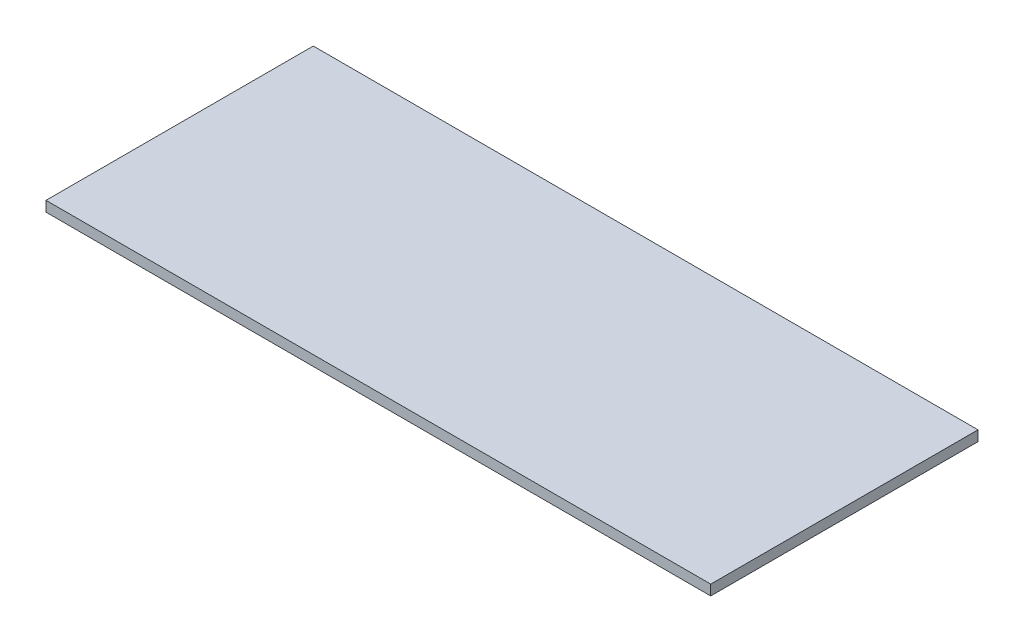
ISO-10303-21;
HEADER;
FILE_DESCRIPTION(('STEP AP214'),'2;1');
FILE_NAME('part.step','',(''),(''),'','','');
FILE_SCHEMA(('AUTOMOTIVE_DESIGN { 1 0 10303 214 1 1 1 1 }'));
ENDSEC;
DATA;
#1=APPLICATION_CONTEXT('core data for automotive mechanical design processes');
#2=APPLICATION_PROTOCOL_DEFINITION('international standard','automotive_design',2000,#1);
#3=PRODUCT_CONTEXT('',#1,'mechanical');
#4=PRODUCT('Part','Part','',(#3));
#5=PRODUCT_RELATED_PRODUCT_CATEGORY('part','',(#4));
#6=PRODUCT_DEFINITION_FORMATION('','',#4);
#7=PRODUCT_DEFINITION_CONTEXT('part definition',#1,'design');
#8=PRODUCT_DEFINITION('design','',#6,#7);
#9=PRODUCT_DEFINITION_SHAPE('','',#8);
#10=(LENGTH_UNIT() NAMED_UNIT(*) SI_UNIT(.MILLI.,.METRE.));
#11=(NAMED_UNIT(*) PLANE_ANGLE_UNIT() SI_UNIT($,.RADIAN.));
#12=(NAMED_UNIT(*) SI_UNIT($,.STERADIAN.) SOLID_ANGLE_UNIT());
#13=UNCERTAINTY_MEASURE_WITH_UNIT(LENGTH_MEASURE(1.E-05),#10,'distance_accuracy_value','');
#14=(GEOMETRIC_REPRESENTATION_CONTEXT(3) GLOBAL_UNCERTAINTY_ASSIGNED_CONTEXT((#13)) GLOBAL_UNIT_ASSIGNED_CONTEXT((#10,
#11,#12)) REPRESENTATION_CONTEXT('',''));
#15=CARTESIAN_POINT('',(0.,0.,0.));
#16=DIRECTION('',(0.,0.,1.));
#17=DIRECTION('',(1.,0.,0.));
#18=AXIS2_PLACEMENT_3D('',#15,#16,#17);
#19=CARTESIAN_POINT('',(-97.,3.,39.));
#20=DIRECTION('',(1.,0.,0.));
#21=DIRECTION('',(0.,0.,-1.));
#22=AXIS2_PLACEMENT_3D('',#19,#20,#21);
#23=PLANE('',#22);
#24=DIRECTION('',(0.,0.,1.));
#25=VECTOR('',#24,1.);
#26=CARTESIAN_POINT('',(-97.,0.,39.));
#27=LINE('',#26,#25);
#28=CARTESIAN_POINT('',(-97.,0.,-39.));
#29=VERTEX_POINT('',#28);
#30=CARTESIAN_POINT('',(-97.,0.,39.));
#31=VERTEX_POINT('',#30);
#32=EDGE_CURVE('E100',#29,#31,#27,.T.);
#33=ORIENTED_EDGE('',*,*,#32,.T.);
#34=DIRECTION('',(0.,-1.,0.));
#35=VECTOR('',#34,1.);
#36=CARTESIAN_POINT('',(-97.,3.,39.));
#37=LINE('',#36,#35);
#38=CARTESIAN_POINT('',(-97.,3.,39.));
#39=VERTEX_POINT('',#38);
#40=EDGE_CURVE('E11',#39,#31,#37,.T.);
#41=ORIENTED_EDGE('',*,*,#40,.F.);
#42=DIRECTION('',(0.,0.,1.));
#43=VECTOR('',#42,1.);
#44=CARTESIAN_POINT('',(-97.,3.,39.));
#45=LINE('',#44,#43);
#46=CARTESIAN_POINT('',(-97.,3.,-39.));
#47=VERTEX_POINT('',#46);
#48=EDGE_CURVE('E88',#47,#39,#45,.T.);
#49=ORIENTED_EDGE('',*,*,#48,.F.);
#50=DIRECTION('',(0.,-1.,0.));
#51=VECTOR('',#50,1.);
#52=CARTESIAN_POINT('',(-97.,3.,-39.));
#53=LINE('',#52,#51);
#54=EDGE_CURVE('E96',#47,#29,#53,.T.);
#55=ORIENTED_EDGE('',*,*,#54,.T.);
#56=EDGE_LOOP('',(#33,#41,#49,#55));
#57=FACE_BOUND('',#56,.T.);
#58=ADVANCED_FACE('F37',(#57),#23,.F.);
#59=CARTESIAN_POINT('',(97.,3.,39.));
#60=DIRECTION('',(0.,0.,-1.));
#61=DIRECTION('',(-1.,0.,0.));
#62=AXIS2_PLACEMENT_3D('',#59,#60,#61);
#63=PLANE('',#62);
#64=DIRECTION('',(1.,0.,0.));
#65=VECTOR('',#64,1.);
#66=CARTESIAN_POINT('',(97.,0.,39.));
#67=LINE('',#66,#65);
#68=CARTESIAN_POINT('',(97.,0.,39.));
#69=VERTEX_POINT('',#68);
#70=EDGE_CURVE('E92',#31,#69,#67,.T.);
#71=ORIENTED_EDGE('',*,*,#70,.T.);
#72=DIRECTION('',(0.,-1.,0.));
#73=VECTOR('',#72,1.);
#74=CARTESIAN_POINT('',(97.,3.,39.));
#75=LINE('',#74,#73);
#76=CARTESIAN_POINT('',(97.,3.,39.));
#77=VERTEX_POINT('',#76);
#78=EDGE_CURVE('E45',#77,#69,#75,.T.);
#79=ORIENTED_EDGE('',*,*,#78,.F.);
#80=DIRECTION('',(1.,0.,0.));
#81=VECTOR('',#80,1.);
#82=CARTESIAN_POINT('',(97.,3.,39.));
#83=LINE('',#82,#81);
#84=EDGE_CURVE('E83',#39,#77,#83,.T.);
#85=ORIENTED_EDGE('',*,*,#84,.F.);
#86=ORIENTED_EDGE('',*,*,#40,.T.);
#87=EDGE_LOOP('',(#71,#79,#85,#86));
#88=FACE_BOUND('',#87,.T.);
#89=ADVANCED_FACE('F91',(#88),#63,.F.);
#90=CARTESIAN_POINT('',(97.,3.,39.));
#91=DIRECTION('',(-1.,0.,0.));
#92=DIRECTION('',(0.,0.,1.));
#93=AXIS2_PLACEMENT_3D('',#90,#91,#92);
#94=PLANE('',#93);
#95=DIRECTION('',(0.,0.,-1.));
#96=VECTOR('',#95,1.);
#97=CARTESIAN_POINT('',(97.,0.,39.));
#98=LINE('',#97,#96);
#99=CARTESIAN_POINT('',(97.,0.,-39.));
#100=VERTEX_POINT('',#99);
#101=EDGE_CURVE('E70',#69,#100,#98,.T.);
#102=ORIENTED_EDGE('',*,*,#101,.T.);
#103=DIRECTION('',(0.,-1.,0.));
#104=VECTOR('',#103,1.);
#105=CARTESIAN_POINT('',(97.,3.,-39.));
#106=LINE('',#105,#104);
#107=CARTESIAN_POINT('',(97.,3.,-39.));
#108=VERTEX_POINT('',#107);
#109=EDGE_CURVE('E93',#108,#100,#106,.T.);
#110=ORIENTED_EDGE('',*,*,#109,.F.);
#111=DIRECTION('',(0.,0.,-1.));
#112=VECTOR('',#111,1.);
#113=CARTESIAN_POINT('',(97.,3.,39.));
#114=LINE('',#113,#112);
#115=EDGE_CURVE('E86',#77,#108,#114,.T.);
#116=ORIENTED_EDGE('',*,*,#115,.F.);
#117=ORIENTED_EDGE('',*,*,#78,.T.);
#118=EDGE_LOOP('',(#102,#110,#116,#117));
#119=FACE_BOUND('',#118,.T.);
#120=ADVANCED_FACE('F94',(#119),#94,.F.);
#121=CARTESIAN_POINT('',(97.,3.,-39.));
#122=DIRECTION('',(0.,0.,1.));
#123=DIRECTION('',(1.,0.,0.));
#124=AXIS2_PLACEMENT_3D('',#121,#122,#123);
#125=PLANE('',#124);
#126=DIRECTION('',(-1.,0.,0.));
#127=VECTOR('',#126,1.);
#128=CARTESIAN_POINT('',(97.,0.,-39.));
#129=LINE('',#128,#127);
#130=EDGE_CURVE('E76',#100,#29,#129,.T.);
#131=ORIENTED_EDGE('',*,*,#130,.T.);
#132=ORIENTED_EDGE('',*,*,#54,.F.);
#133=DIRECTION('',(-1.,0.,0.));
#134=VECTOR('',#133,1.);
#135=CARTESIAN_POINT('',(97.,3.,-39.));
#136=LINE('',#135,#134);
#137=EDGE_CURVE('E53',#108,#47,#136,.T.);
#138=ORIENTED_EDGE('',*,*,#137,.F.);
#139=ORIENTED_EDGE('',*,*,#109,.T.);
#140=EDGE_LOOP('',(#131,#132,#138,#139));
#141=FACE_BOUND('',#140,.T.);
#142=ADVANCED_FACE('F107',(#141),#125,.F.);
#143=CARTESIAN_POINT('',(0.,3.,0.));
#144=DIRECTION('',(0.,1.,0.));
#145=DIRECTION('',(0.,0.,1.));
#146=AXIS2_PLACEMENT_3D('',#143,#144,#145);
#147=PLANE('',#146);
#148=ORIENTED_EDGE('',*,*,#48,.T.);
#149=ORIENTED_EDGE('',*,*,#84,.T.);
#150=ORIENTED_EDGE('',*,*,#115,.T.);
#151=ORIENTED_EDGE('',*,*,#137,.T.);
#152=EDGE_LOOP('',(#148,#149,#150,#151));
#153=FACE_BOUND('',#152,.T.);
#154=ADVANCED_FACE('F84',(#153),#147,.T.);
#155=CARTESIAN_POINT('',(0.,0.,0.));
#156=DIRECTION('',(0.,1.,0.));
#157=DIRECTION('',(0.,0.,1.));
#158=AXIS2_PLACEMENT_3D('',#155,#156,#157);
#159=PLANE('',#158);
#160=ORIENTED_EDGE('',*,*,#32,.F.);
#161=ORIENTED_EDGE('',*,*,#130,.F.);
#162=ORIENTED_EDGE('',*,*,#101,.F.);
#163=ORIENTED_EDGE('',*,*,#70,.F.);
#164=EDGE_LOOP('',(#160,#161,#162,#163));
#165=FACE_BOUND('',#164,.T.);
#166=ADVANCED_FACE('F110',(#165),#159,.F.);
#167=CLOSED_SHELL('',(#58,#89,#120,#142,#154,#166));
#168=MANIFOLD_SOLID_BREP('B2',#167);
#169=ADVANCED_BREP_SHAPE_REPRESENTATION('',(#18,#168),#14);
#170=SHAPE_DEFINITION_REPRESENTATION(#9,#169);
ENDSEC;
END-ISO-10303-21;
